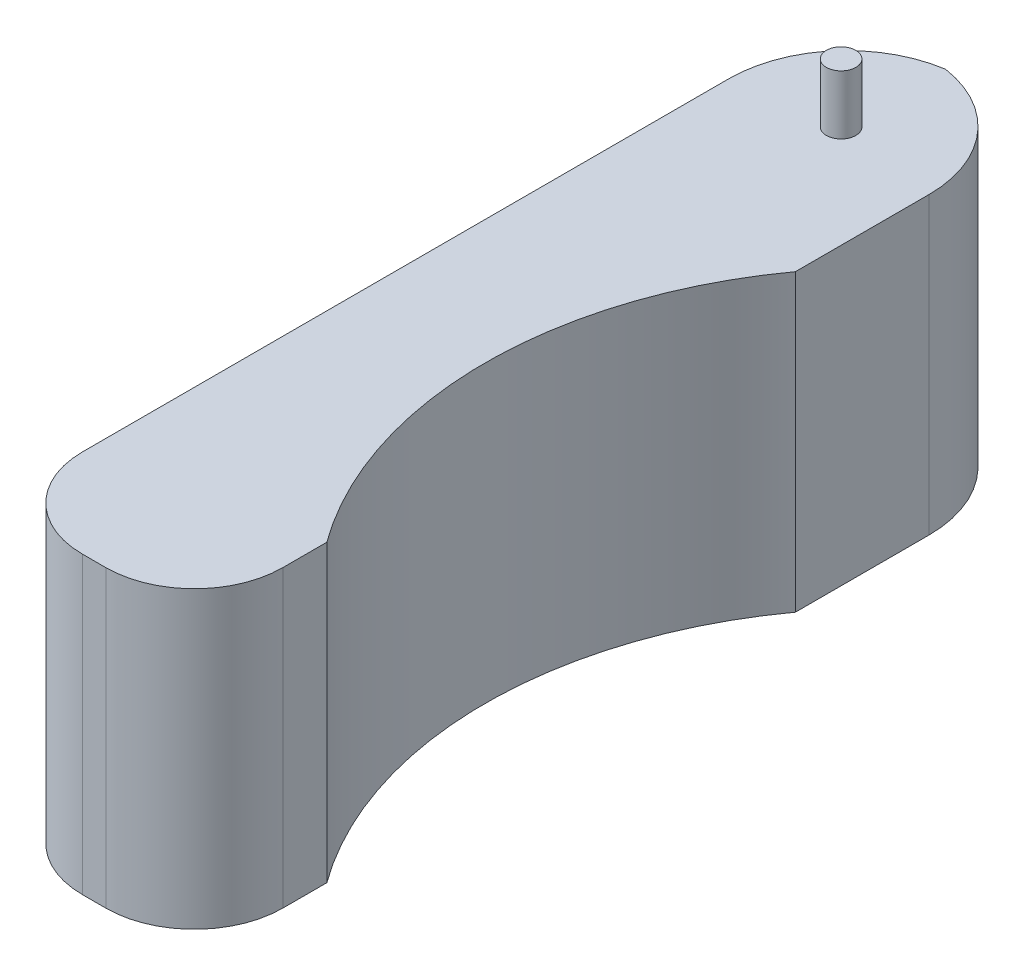
ISO-10303-21;
HEADER;
FILE_DESCRIPTION(('STEP AP214'),'2;1');
FILE_NAME('part.step','',(''),(''),'','','');
FILE_SCHEMA(('AUTOMOTIVE_DESIGN { 1 0 10303 214 1 1 1 1 }'));
ENDSEC;
DATA;
#1=APPLICATION_CONTEXT('core data for automotive mechanical design processes');
#2=APPLICATION_PROTOCOL_DEFINITION('international standard','automotive_design',2000,#1);
#3=PRODUCT_CONTEXT('',#1,'mechanical');
#4=PRODUCT('Part','Part','',(#3));
#5=PRODUCT_RELATED_PRODUCT_CATEGORY('part','',(#4));
#6=PRODUCT_DEFINITION_FORMATION('','',#4);
#7=PRODUCT_DEFINITION_CONTEXT('part definition',#1,'design');
#8=PRODUCT_DEFINITION('design','',#6,#7);
#9=PRODUCT_DEFINITION_SHAPE('','',#8);
#10=(LENGTH_UNIT() NAMED_UNIT(*) SI_UNIT(.MILLI.,.METRE.));
#11=(NAMED_UNIT(*) PLANE_ANGLE_UNIT() SI_UNIT($,.RADIAN.));
#12=(NAMED_UNIT(*) SI_UNIT($,.STERADIAN.) SOLID_ANGLE_UNIT());
#13=UNCERTAINTY_MEASURE_WITH_UNIT(LENGTH_MEASURE(1.E-05),#10,'distance_accuracy_value','');
#14=(GEOMETRIC_REPRESENTATION_CONTEXT(3) GLOBAL_UNCERTAINTY_ASSIGNED_CONTEXT((#13)) GLOBAL_UNIT_ASSIGNED_CONTEXT((#10,
#11,#12)) REPRESENTATION_CONTEXT('',''));
#15=CARTESIAN_POINT('',(0.,0.,0.));
#16=DIRECTION('',(0.,0.,1.));
#17=DIRECTION('',(1.,0.,0.));
#18=AXIS2_PLACEMENT_3D('',#15,#16,#17);
#19=CARTESIAN_POINT('',(-13.1951362502642,50.,-60.360729655464));
#20=DIRECTION('',(1.,0.,0.));
#21=DIRECTION('',(0.,0.,-1.));
#22=AXIS2_PLACEMENT_3D('',#19,#20,#21);
#23=PLANE('',#22);
#24=DIRECTION('',(0.,0.,1.));
#25=VECTOR('',#24,1.);
#26=CARTESIAN_POINT('',(-13.1951362502642,50.,-60.360729655464));
#27=LINE('',#26,#25);
#28=CARTESIAN_POINT('',(-13.1951362502642,50.,-40.360729655464));
#29=VERTEX_POINT('',#28);
#30=CARTESIAN_POINT('',(-13.1951362502642,50.,69.2242739378566));
#31=VERTEX_POINT('',#30);
#32=EDGE_CURVE('E127',#29,#31,#27,.T.);
#33=ORIENTED_EDGE('',*,*,#32,.F.);
#34=DIRECTION('',(0.,-1.,0.));
#35=VECTOR('',#34,1.);
#36=CARTESIAN_POINT('',(-13.1951362502642,0.,-40.360729655464));
#37=LINE('',#36,#35);
#38=CARTESIAN_POINT('',(-13.1951362502642,0.,-40.360729655464));
#39=VERTEX_POINT('',#38);
#40=EDGE_CURVE('E176',#29,#39,#37,.T.);
#41=ORIENTED_EDGE('',*,*,#40,.T.);
#42=DIRECTION('',(0.,0.,1.));
#43=VECTOR('',#42,1.);
#44=CARTESIAN_POINT('',(-13.1951362502642,0.,-60.360729655464));
#45=LINE('',#44,#43);
#46=CARTESIAN_POINT('',(-13.1951362502642,0.,69.2242739378566));
#47=VERTEX_POINT('',#46);
#48=EDGE_CURVE('E118',#39,#47,#45,.T.);
#49=ORIENTED_EDGE('',*,*,#48,.T.);
#50=DIRECTION('',(0.,-1.,0.));
#51=VECTOR('',#50,1.);
#52=CARTESIAN_POINT('',(-13.1951362502642,50.,69.2242739378566));
#53=LINE('',#52,#51);
#54=EDGE_CURVE('E172',#31,#47,#53,.T.);
#55=ORIENTED_EDGE('',*,*,#54,.F.);
#56=EDGE_LOOP('',(#33,#41,#49,#55));
#57=FACE_BOUND('',#56,.T.);
#58=ADVANCED_FACE('F40',(#57),#23,.F.);
#59=CARTESIAN_POINT('',(1.80486374973578,50.,69.2242739378567));
#60=DIRECTION('',(0.,-1.,0.));
#61=DIRECTION('',(0.,0.,-1.));
#62=AXIS2_PLACEMENT_3D('',#59,#60,#61);
#63=CYLINDRICAL_SURFACE('',#62,15.);
#64=CARTESIAN_POINT('',(1.80486374973578,0.,69.2242739378567));
#65=DIRECTION('',(0.,1.,0.));
#66=DIRECTION('',(0.,0.,1.));
#67=AXIS2_PLACEMENT_3D('',#64,#65,#66);
#68=CIRCLE('',#67,15.);
#69=CARTESIAN_POINT('',(1.80486374973588,0.,84.2242739378567));
#70=VERTEX_POINT('',#69);
#71=EDGE_CURVE('E167',#47,#70,#68,.T.);
#72=ORIENTED_EDGE('',*,*,#71,.T.);
#73=DIRECTION('',(0.,-1.,0.));
#74=VECTOR('',#73,1.);
#75=CARTESIAN_POINT('',(1.80486374973588,50.,84.2242739378567));
#76=LINE('',#75,#74);
#77=CARTESIAN_POINT('',(1.80486374973588,50.,84.2242739378567));
#78=VERTEX_POINT('',#77);
#79=EDGE_CURVE('E177',#78,#70,#76,.T.);
#80=ORIENTED_EDGE('',*,*,#79,.F.);
#81=CARTESIAN_POINT('',(1.80486374973578,50.,69.2242739378567));
#82=DIRECTION('',(0.,1.,0.));
#83=DIRECTION('',(0.,0.,1.));
#84=AXIS2_PLACEMENT_3D('',#81,#82,#83);
#85=CIRCLE('',#84,15.);
#86=EDGE_CURVE('E145',#31,#78,#85,.T.);
#87=ORIENTED_EDGE('',*,*,#86,.F.);
#88=ORIENTED_EDGE('',*,*,#54,.T.);
#89=EDGE_LOOP('',(#72,#80,#87,#88));
#90=FACE_BOUND('',#89,.T.);
#91=ADVANCED_FACE('F242',(#90),#63,.T.);
#92=CARTESIAN_POINT('',(1.80486374973588,50.,84.2242739378567));
#93=DIRECTION('',(0.,0.,-1.));
#94=DIRECTION('',(-1.,0.,0.));
#95=AXIS2_PLACEMENT_3D('',#92,#93,#94);
#96=PLANE('',#95);
#97=DIRECTION('',(1.,0.,0.));
#98=VECTOR('',#97,1.);
#99=CARTESIAN_POINT('',(1.80486374973588,0.,84.2242739378567));
#100=LINE('',#99,#98);
#101=CARTESIAN_POINT('',(5.77532090467122,0.,84.2242739378567));
#102=VERTEX_POINT('',#101);
#103=EDGE_CURVE('E164',#70,#102,#100,.T.);
#104=ORIENTED_EDGE('',*,*,#103,.T.);
#105=DIRECTION('',(0.,-1.,0.));
#106=VECTOR('',#105,1.);
#107=CARTESIAN_POINT('',(5.77532090467122,50.,84.2242739378567));
#108=LINE('',#107,#106);
#109=CARTESIAN_POINT('',(5.77532090467122,50.,84.2242739378567));
#110=VERTEX_POINT('',#109);
#111=EDGE_CURVE('E181',#110,#102,#108,.T.);
#112=ORIENTED_EDGE('',*,*,#111,.F.);
#113=DIRECTION('',(1.,0.,0.));
#114=VECTOR('',#113,1.);
#115=CARTESIAN_POINT('',(1.80486374973588,50.,84.2242739378567));
#116=LINE('',#115,#114);
#117=EDGE_CURVE('E142',#78,#110,#116,.T.);
#118=ORIENTED_EDGE('',*,*,#117,.F.);
#119=ORIENTED_EDGE('',*,*,#79,.T.);
#120=EDGE_LOOP('',(#104,#112,#118,#119));
#121=FACE_BOUND('',#120,.T.);
#122=ADVANCED_FACE('F249',(#121),#96,.F.);
#123=CARTESIAN_POINT('',(5.77532090467133,50.,69.2242739378567));
#124=DIRECTION('',(0.,-1.,0.));
#125=DIRECTION('',(0.,0.,-1.));
#126=AXIS2_PLACEMENT_3D('',#123,#124,#125);
#127=CYLINDRICAL_SURFACE('',#126,15.);
#128=CARTESIAN_POINT('',(5.77532090467133,0.,69.2242739378567));
#129=DIRECTION('',(0.,1.,0.));
#130=DIRECTION('',(0.,0.,1.));
#131=AXIS2_PLACEMENT_3D('',#128,#129,#130);
#132=CIRCLE('',#131,15.);
#133=CARTESIAN_POINT('',(20.7753209046713,0.,69.2242739378566));
#134=VERTEX_POINT('',#133);
#135=EDGE_CURVE('E160',#102,#134,#132,.T.);
#136=ORIENTED_EDGE('',*,*,#135,.T.);
#137=DIRECTION('',(0.,-1.,0.));
#138=VECTOR('',#137,1.);
#139=CARTESIAN_POINT('',(20.7753209046713,50.,69.2242739378566));
#140=LINE('',#139,#138);
#141=CARTESIAN_POINT('',(20.7753209046713,50.,69.2242739378566));
#142=VERTEX_POINT('',#141);
#143=EDGE_CURVE('E185',#142,#134,#140,.T.);
#144=ORIENTED_EDGE('',*,*,#143,.F.);
#145=CARTESIAN_POINT('',(5.77532090467133,50.,69.2242739378567));
#146=DIRECTION('',(0.,1.,0.));
#147=DIRECTION('',(0.,0.,1.));
#148=AXIS2_PLACEMENT_3D('',#145,#146,#147);
#149=CIRCLE('',#148,15.);
#150=EDGE_CURVE('E136',#110,#142,#149,.T.);
#151=ORIENTED_EDGE('',*,*,#150,.F.);
#152=ORIENTED_EDGE('',*,*,#111,.T.);
#153=EDGE_LOOP('',(#136,#144,#151,#152));
#154=FACE_BOUND('',#153,.T.);
#155=ADVANCED_FACE('F255',(#154),#127,.T.);
#156=CARTESIAN_POINT('',(20.7753209046713,50.,61.7644675544282));
#157=DIRECTION('',(1.,0.,0.));
#158=DIRECTION('',(0.,0.,-1.));
#159=AXIS2_PLACEMENT_3D('',#156,#157,#158);
#160=PLANE('',#159);
#161=DIRECTION('',(0.,0.,1.));
#162=VECTOR('',#161,1.);
#163=CARTESIAN_POINT('',(20.7753209046713,0.,61.7644675544282));
#164=LINE('',#163,#162);
#165=CARTESIAN_POINT('',(20.7753209046713,0.,61.7644675544282));
#166=VERTEX_POINT('',#165);
#167=EDGE_CURVE('E156',#166,#134,#164,.T.);
#168=ORIENTED_EDGE('',*,*,#167,.F.);
#169=DIRECTION('',(0.,-1.,0.));
#170=VECTOR('',#169,1.);
#171=CARTESIAN_POINT('',(20.7753209046713,50.,61.7644675544282));
#172=LINE('',#171,#170);
#173=CARTESIAN_POINT('',(20.7753209046713,50.,61.7644675544282));
#174=VERTEX_POINT('',#173);
#175=EDGE_CURVE('E126',#174,#166,#172,.T.);
#176=ORIENTED_EDGE('',*,*,#175,.F.);
#177=DIRECTION('',(0.,0.,1.));
#178=VECTOR('',#177,1.);
#179=CARTESIAN_POINT('',(20.7753209046713,50.,61.7644675544282));
#180=LINE('',#179,#178);
#181=EDGE_CURVE('E132',#174,#142,#180,.T.);
#182=ORIENTED_EDGE('',*,*,#181,.T.);
#183=ORIENTED_EDGE('',*,*,#143,.T.);
#184=EDGE_LOOP('',(#168,#176,#182,#183));
#185=FACE_BOUND('',#184,.T.);
#186=ADVANCED_FACE('F259',(#185),#160,.T.);
#187=CARTESIAN_POINT('',(75.432441833817,50.,22.0386850137392));
#188=DIRECTION('',(0.,-1.,0.));
#189=DIRECTION('',(0.,0.,-1.));
#190=AXIS2_PLACEMENT_3D('',#187,#188,#189);
#191=CYLINDRICAL_SURFACE('',#190,67.5687699069132);
#192=CARTESIAN_POINT('',(75.432441833817,0.,22.0386850137392));
#193=DIRECTION('',(0.,1.,0.));
#194=DIRECTION('',(0.,0.,1.));
#195=AXIS2_PLACEMENT_3D('',#192,#193,#194);
#196=CIRCLE('',#195,67.5687699069132);
#197=CARTESIAN_POINT('',(20.7753209046713,0.,-17.6870975269499));
#198=VERTEX_POINT('',#197);
#199=EDGE_CURVE('E124',#198,#166,#196,.T.);
#200=ORIENTED_EDGE('',*,*,#199,.F.);
#201=DIRECTION('',(0.,-1.,0.));
#202=VECTOR('',#201,1.);
#203=CARTESIAN_POINT('',(20.7753209046713,50.,-17.6870975269499));
#204=LINE('',#203,#202);
#205=CARTESIAN_POINT('',(20.7753209046713,50.,-17.6870975269499));
#206=VERTEX_POINT('',#205);
#207=EDGE_CURVE('E113',#206,#198,#204,.T.);
#208=ORIENTED_EDGE('',*,*,#207,.F.);
#209=CARTESIAN_POINT('',(75.432441833817,50.,22.0386850137392));
#210=DIRECTION('',(0.,1.,0.));
#211=DIRECTION('',(0.,0.,1.));
#212=AXIS2_PLACEMENT_3D('',#209,#210,#211);
#213=CIRCLE('',#212,67.5687699069132);
#214=EDGE_CURVE('E117',#206,#174,#213,.T.);
#215=ORIENTED_EDGE('',*,*,#214,.T.);
#216=ORIENTED_EDGE('',*,*,#175,.T.);
#217=EDGE_LOOP('',(#200,#208,#215,#216));
#218=FACE_BOUND('',#217,.T.);
#219=ADVANCED_FACE('F122',(#218),#191,.F.);
#220=CARTESIAN_POINT('',(20.7753209046713,50.,-60.360729655464));
#221=DIRECTION('',(1.,0.,0.));
#222=DIRECTION('',(0.,0.,-1.));
#223=AXIS2_PLACEMENT_3D('',#220,#221,#222);
#224=PLANE('',#223);
#225=DIRECTION('',(0.,0.,1.));
#226=VECTOR('',#225,1.);
#227=CARTESIAN_POINT('',(20.7753209046713,0.,-60.360729655464));
#228=LINE('',#227,#226);
#229=CARTESIAN_POINT('',(20.7753209046713,0.,-40.360729655464));
#230=VERTEX_POINT('',#229);
#231=EDGE_CURVE('E150',#230,#198,#228,.T.);
#232=ORIENTED_EDGE('',*,*,#231,.F.);
#233=DIRECTION('',(0.,-1.,0.));
#234=VECTOR('',#233,1.);
#235=CARTESIAN_POINT('',(20.7753209046713,50.,-40.360729655464));
#236=LINE('',#235,#234);
#237=CARTESIAN_POINT('',(20.7753209046713,50.,-40.360729655464));
#238=VERTEX_POINT('',#237);
#239=EDGE_CURVE('E11',#230,#238,#236,.F.);
#240=ORIENTED_EDGE('',*,*,#239,.T.);
#241=DIRECTION('',(0.,0.,1.));
#242=VECTOR('',#241,1.);
#243=CARTESIAN_POINT('',(20.7753209046713,50.,-60.360729655464));
#244=LINE('',#243,#242);
#245=EDGE_CURVE('E110',#238,#206,#244,.T.);
#246=ORIENTED_EDGE('',*,*,#245,.T.);
#247=ORIENTED_EDGE('',*,*,#207,.T.);
#248=EDGE_LOOP('',(#232,#240,#246,#247));
#249=FACE_BOUND('',#248,.T.);
#250=ADVANCED_FACE('F112',(#249),#224,.T.);
#251=CARTESIAN_POINT('',(75.432441833817,50.,22.0386850137392));
#252=DIRECTION('',(0.,1.,0.));
#253=DIRECTION('',(0.,0.,1.));
#254=AXIS2_PLACEMENT_3D('',#251,#252,#253);
#255=PLANE('',#254);
#256=CARTESIAN_POINT('',(3.40310626433299,50.,-42.8007436134717));
#257=DIRECTION('',(0.,1.,0.));
#258=DIRECTION('',(0.,0.,1.));
#259=AXIS2_PLACEMENT_3D('',#256,#257,#258);
#260=CIRCLE('',#259,2.5);
#261=CARTESIAN_POINT('',(3.40310626433299,50.,-40.3007436134717));
#262=VERTEX_POINT('',#261);
#263=EDGE_CURVE('E218',#262,#262,#260,.T.);
#264=ORIENTED_EDGE('',*,*,#263,.F.);
#265=EDGE_LOOP('',(#264));
#266=FACE_BOUND('',#265,.T.);
#267=CARTESIAN_POINT('',(0.775320904671327,50.,-40.360729655464));
#268=DIRECTION('',(0.,1.,0.));
#269=DIRECTION('',(0.,0.,1.));
#270=AXIS2_PLACEMENT_3D('',#267,#268,#269);
#271=CIRCLE('',#270,20.);
#272=CARTESIAN_POINT('',(3.79009232720355,50.,-60.132202874976));
#273=VERTEX_POINT('',#272);
#274=EDGE_CURVE('E57',#238,#273,#271,.T.);
#275=ORIENTED_EDGE('',*,*,#274,.T.);
#276=CARTESIAN_POINT('',(6.80486374973578,50.,-40.360729655464));
#277=DIRECTION('',(0.,1.,0.));
#278=DIRECTION('',(0.,0.,1.));
#279=AXIS2_PLACEMENT_3D('',#276,#277,#278);
#280=CIRCLE('',#279,20.);
#281=EDGE_CURVE('E50',#273,#29,#280,.T.);
#282=ORIENTED_EDGE('',*,*,#281,.T.);
#283=ORIENTED_EDGE('',*,*,#32,.T.);
#284=ORIENTED_EDGE('',*,*,#86,.T.);
#285=ORIENTED_EDGE('',*,*,#117,.T.);
#286=ORIENTED_EDGE('',*,*,#150,.T.);
#287=ORIENTED_EDGE('',*,*,#181,.F.);
#288=ORIENTED_EDGE('',*,*,#214,.F.);
#289=ORIENTED_EDGE('',*,*,#245,.F.);
#290=EDGE_LOOP('',(#275,#282,#283,#284,#285,#286,#287,#288,#289));
#291=FACE_BOUND('',#290,.T.);
#292=ADVANCED_FACE('F130',(#266,#291),#255,.T.);
#293=CARTESIAN_POINT('',(75.432441833817,0.,22.0386850137392));
#294=DIRECTION('',(0.,1.,0.));
#295=DIRECTION('',(0.,0.,1.));
#296=AXIS2_PLACEMENT_3D('',#293,#294,#295);
#297=PLANE('',#296);
#298=ORIENTED_EDGE('',*,*,#48,.F.);
#299=CARTESIAN_POINT('',(6.80486374973578,0.,-40.360729655464));
#300=DIRECTION('',(0.,1.,0.));
#301=DIRECTION('',(0.,0.,1.));
#302=AXIS2_PLACEMENT_3D('',#299,#300,#301);
#303=CIRCLE('',#302,20.);
#304=CARTESIAN_POINT('',(3.79009232720355,0.,-60.132202874976));
#305=VERTEX_POINT('',#304);
#306=EDGE_CURVE('E196',#39,#305,#303,.F.);
#307=ORIENTED_EDGE('',*,*,#306,.T.);
#308=CARTESIAN_POINT('',(0.775320904671327,0.,-40.360729655464));
#309=DIRECTION('',(0.,1.,0.));
#310=DIRECTION('',(0.,0.,1.));
#311=AXIS2_PLACEMENT_3D('',#308,#309,#310);
#312=CIRCLE('',#311,20.);
#313=EDGE_CURVE('E193',#305,#230,#312,.F.);
#314=ORIENTED_EDGE('',*,*,#313,.T.);
#315=ORIENTED_EDGE('',*,*,#231,.T.);
#316=ORIENTED_EDGE('',*,*,#199,.T.);
#317=ORIENTED_EDGE('',*,*,#167,.T.);
#318=ORIENTED_EDGE('',*,*,#135,.F.);
#319=ORIENTED_EDGE('',*,*,#103,.F.);
#320=ORIENTED_EDGE('',*,*,#71,.F.);
#321=EDGE_LOOP('',(#298,#307,#314,#315,#316,#317,#318,#319,#320));
#322=FACE_BOUND('',#321,.T.);
#323=ADVANCED_FACE('F214',(#322),#297,.F.);
#324=CARTESIAN_POINT('',(3.40310626433299,60.,-42.8007436134717));
#325=DIRECTION('',(0.,-1.,0.));
#326=DIRECTION('',(0.,0.,-1.));
#327=AXIS2_PLACEMENT_3D('',#324,#325,#326);
#328=CYLINDRICAL_SURFACE('',#327,2.5);
#329=CARTESIAN_POINT('',(3.40310626433299,60.,-42.8007436134717));
#330=DIRECTION('',(0.,1.,0.));
#331=DIRECTION('',(0.,0.,1.));
#332=AXIS2_PLACEMENT_3D('',#329,#330,#331);
#333=CIRCLE('',#332,2.5);
#334=CARTESIAN_POINT('',(3.40310626433299,60.,-40.3007436134717));
#335=VERTEX_POINT('',#334);
#336=EDGE_CURVE('E153',#335,#335,#333,.T.);
#337=ORIENTED_EDGE('',*,*,#336,.F.);
#338=EDGE_LOOP('',(#337));
#339=FACE_BOUND('',#338,.T.);
#340=ORIENTED_EDGE('',*,*,#263,.T.);
#341=EDGE_LOOP('',(#340));
#342=FACE_BOUND('',#341,.T.);
#343=ADVANCED_FACE('F230',(#339,#342),#328,.T.);
#344=CARTESIAN_POINT('',(3.40310626433299,60.,-42.8007436134717));
#345=DIRECTION('',(0.,1.,0.));
#346=DIRECTION('',(0.,0.,1.));
#347=AXIS2_PLACEMENT_3D('',#344,#345,#346);
#348=PLANE('',#347);
#349=ORIENTED_EDGE('',*,*,#336,.T.);
#350=EDGE_LOOP('',(#349));
#351=FACE_BOUND('',#350,.T.);
#352=ADVANCED_FACE('F228',(#351),#348,.T.);
#353=CARTESIAN_POINT('',(0.775320904671327,50.,-40.360729655464));
#354=DIRECTION('',(0.,-1.,0.));
#355=DIRECTION('',(0.,0.,-1.));
#356=AXIS2_PLACEMENT_3D('',#353,#354,#355);
#357=CYLINDRICAL_SURFACE('',#356,20.);
#358=DIRECTION('',(0.,-1.,0.));
#359=VECTOR('',#358,1.);
#360=CARTESIAN_POINT('',(3.79009232720355,25.,-60.132202874976));
#361=LINE('',#360,#359);
#362=EDGE_CURVE('E44',#273,#305,#361,.T.);
#363=ORIENTED_EDGE('',*,*,#362,.F.);
#364=ORIENTED_EDGE('',*,*,#274,.F.);
#365=ORIENTED_EDGE('',*,*,#239,.F.);
#366=ORIENTED_EDGE('',*,*,#313,.F.);
#367=EDGE_LOOP('',(#363,#364,#365,#366));
#368=FACE_BOUND('',#367,.T.);
#369=ADVANCED_FACE('F42',(#368),#357,.T.);
#370=CARTESIAN_POINT('',(6.80486374973578,50.,-40.360729655464));
#371=DIRECTION('',(0.,1.,0.));
#372=DIRECTION('',(0.,0.,1.));
#373=AXIS2_PLACEMENT_3D('',#370,#371,#372);
#374=CYLINDRICAL_SURFACE('',#373,20.);
#375=ORIENTED_EDGE('',*,*,#281,.F.);
#376=ORIENTED_EDGE('',*,*,#362,.T.);
#377=ORIENTED_EDGE('',*,*,#306,.F.);
#378=ORIENTED_EDGE('',*,*,#40,.F.);
#379=EDGE_LOOP('',(#375,#376,#377,#378));
#380=FACE_BOUND('',#379,.T.);
#381=ADVANCED_FACE('F211',(#380),#374,.T.);
#382=CLOSED_SHELL('',(#58,#91,#122,#155,#186,#219,#250,#292,#323,#343,#352,#369,#381));
#383=MANIFOLD_SOLID_BREP('B2',#382);
#384=ADVANCED_BREP_SHAPE_REPRESENTATION('',(#18,#383),#14);
#385=SHAPE_DEFINITION_REPRESENTATION(#9,#384);
ENDSEC;
END-ISO-10303-21;
